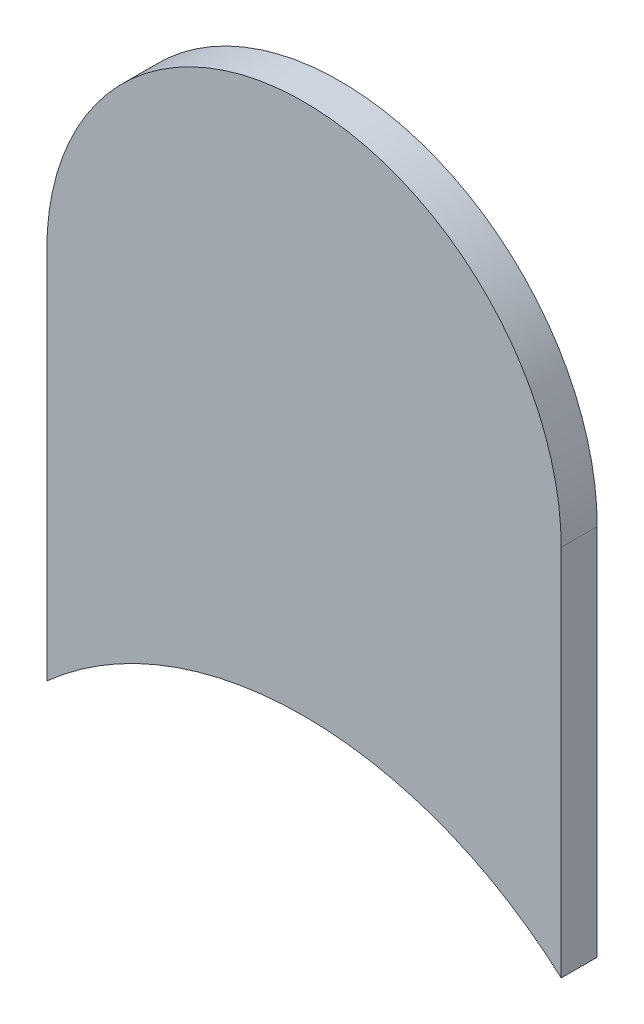
ISO-10303-21;
HEADER;
FILE_DESCRIPTION(('STEP AP214'),'2;1');
FILE_NAME('part.step','',(''),(''),'','','');
FILE_SCHEMA(('AUTOMOTIVE_DESIGN { 1 0 10303 214 1 1 1 1 }'));
ENDSEC;
DATA;
#1=APPLICATION_CONTEXT('core data for automotive mechanical design processes');
#2=APPLICATION_PROTOCOL_DEFINITION('international standard','automotive_design',2000,#1);
#3=PRODUCT_CONTEXT('',#1,'mechanical');
#4=PRODUCT('Part','Part','',(#3));
#5=PRODUCT_RELATED_PRODUCT_CATEGORY('part','',(#4));
#6=PRODUCT_DEFINITION_FORMATION('','',#4);
#7=PRODUCT_DEFINITION_CONTEXT('part definition',#1,'design');
#8=PRODUCT_DEFINITION('design','',#6,#7);
#9=PRODUCT_DEFINITION_SHAPE('','',#8);
#10=(LENGTH_UNIT() NAMED_UNIT(*) SI_UNIT(.MILLI.,.METRE.));
#11=(NAMED_UNIT(*) PLANE_ANGLE_UNIT() SI_UNIT($,.RADIAN.));
#12=(NAMED_UNIT(*) SI_UNIT($,.STERADIAN.) SOLID_ANGLE_UNIT());
#13=UNCERTAINTY_MEASURE_WITH_UNIT(LENGTH_MEASURE(1.E-05),#10,'distance_accuracy_value','');
#14=(GEOMETRIC_REPRESENTATION_CONTEXT(3) GLOBAL_UNCERTAINTY_ASSIGNED_CONTEXT((#13)) GLOBAL_UNIT_ASSIGNED_CONTEXT((#10,
#11,#12)) REPRESENTATION_CONTEXT('',''));
#15=CARTESIAN_POINT('',(0.,0.,0.));
#16=DIRECTION('',(0.,0.,1.));
#17=DIRECTION('',(1.,0.,0.));
#18=AXIS2_PLACEMENT_3D('',#15,#16,#17);
#19=CARTESIAN_POINT('',(148.594,-72.510019,-0.035));
#20=DIRECTION('',(1.,0.,0.));
#21=DIRECTION('',(0.,1.,0.));
#22=AXIS2_PLACEMENT_3D('',#19,#20,#21);
#23=PLANE('',#22);
#24=DIRECTION('',(0.,0.,-1.));
#25=VECTOR('',#24,1.);
#26=CARTESIAN_POINT('',(148.594,-72.87249150281,-0.045));
#27=LINE('',#26,#25);
#28=CARTESIAN_POINT('',(148.594,-72.8724915028,0.));
#29=VERTEX_POINT('',#28);
#30=CARTESIAN_POINT('',(148.594,-72.8724915028,-0.035));
#31=VERTEX_POINT('',#30);
#32=EDGE_CURVE('E11',#29,#31,#27,.T.);
#33=ORIENTED_EDGE('',*,*,#32,.F.);
#34=DIRECTION('',(0.,-1.,0.));
#35=VECTOR('',#34,1.);
#36=CARTESIAN_POINT('',(148.594,-72.510019,0.));
#37=LINE('',#36,#35);
#38=CARTESIAN_POINT('',(148.594,-72.510019,0.));
#39=VERTEX_POINT('',#38);
#40=EDGE_CURVE('E20',#39,#29,#37,.T.);
#41=ORIENTED_EDGE('',*,*,#40,.F.);
#42=DIRECTION('',(0.,0.,1.));
#43=VECTOR('',#42,1.);
#44=CARTESIAN_POINT('',(148.594,-72.510019,-0.035));
#45=LINE('',#44,#43);
#46=CARTESIAN_POINT('',(148.594,-72.510019,-0.035));
#47=VERTEX_POINT('',#46);
#48=EDGE_CURVE('E80',#47,#39,#45,.T.);
#49=ORIENTED_EDGE('',*,*,#48,.F.);
#50=DIRECTION('',(0.,-1.,0.));
#51=VECTOR('',#50,1.);
#52=CARTESIAN_POINT('',(148.594,-72.510019,-0.035));
#53=LINE('',#52,#51);
#54=EDGE_CURVE('E88',#47,#31,#53,.T.);
#55=ORIENTED_EDGE('',*,*,#54,.T.);
#56=EDGE_LOOP('',(#33,#41,#49,#55));
#57=FACE_BOUND('',#56,.T.);
#58=ADVANCED_FACE('F17',(#57),#23,.F.);
#59=CARTESIAN_POINT('',(148.844,-73.152,-0.045));
#60=DIRECTION('',(0.,0.,-1.));
#61=DIRECTION('',(0.,-1.,0.));
#62=AXIS2_PLACEMENT_3D('',#59,#60,#61);
#63=CYLINDRICAL_SURFACE('',#62,0.375);
#64=DIRECTION('',(0.,0.,-1.));
#65=VECTOR('',#64,1.);
#66=CARTESIAN_POINT('',(149.094,-72.87249150281,-0.045));
#67=LINE('',#66,#65);
#68=CARTESIAN_POINT('',(149.094,-72.87249150282,0.));
#69=VERTEX_POINT('',#68);
#70=CARTESIAN_POINT('',(149.094,-72.87249150282,-0.035));
#71=VERTEX_POINT('',#70);
#72=EDGE_CURVE('E101',#69,#71,#67,.T.);
#73=ORIENTED_EDGE('',*,*,#72,.F.);
#74=CARTESIAN_POINT('',(148.844,-73.152,0.));
#75=DIRECTION('',(0.,0.,-1.));
#76=DIRECTION('',(0.,-1.,0.));
#77=AXIS2_PLACEMENT_3D('',#74,#75,#76);
#78=CIRCLE('',#77,0.375);
#79=EDGE_CURVE('E55',#29,#69,#78,.T.);
#80=ORIENTED_EDGE('',*,*,#79,.F.);
#81=ORIENTED_EDGE('',*,*,#32,.T.);
#82=CARTESIAN_POINT('',(148.844,-73.152,-0.035));
#83=DIRECTION('',(0.,0.,-1.));
#84=DIRECTION('',(0.,-1.,0.));
#85=AXIS2_PLACEMENT_3D('',#82,#83,#84);
#86=CIRCLE('',#85,0.375);
#87=EDGE_CURVE('E86',#31,#71,#86,.T.);
#88=ORIENTED_EDGE('',*,*,#87,.T.);
#89=EDGE_LOOP('',(#73,#80,#81,#88));
#90=FACE_BOUND('',#89,.T.);
#91=ADVANCED_FACE('F85',(#90),#63,.F.);
#92=CARTESIAN_POINT('',(149.094,-73.152,0.));
#93=DIRECTION('',(0.,0.,1.));
#94=DIRECTION('',(1.,0.,0.));
#95=AXIS2_PLACEMENT_3D('',#92,#93,#94);
#96=PLANE('',#95);
#97=ORIENTED_EDGE('',*,*,#79,.T.);
#98=DIRECTION('',(0.,1.,0.));
#99=VECTOR('',#98,1.);
#100=CARTESIAN_POINT('',(149.094,-73.152,0.));
#101=LINE('',#100,#99);
#102=CARTESIAN_POINT('',(149.094,-72.510019,0.));
#103=VERTEX_POINT('',#102);
#104=EDGE_CURVE('E105',#69,#103,#101,.T.);
#105=ORIENTED_EDGE('',*,*,#104,.T.);
#106=CARTESIAN_POINT('',(148.844,-72.510019,0.));
#107=DIRECTION('',(0.,0.,1.));
#108=DIRECTION('',(1.,0.,0.));
#109=AXIS2_PLACEMENT_3D('',#106,#107,#108);
#110=CIRCLE('',#109,0.25);
#111=EDGE_CURVE('E65',#103,#39,#110,.T.);
#112=ORIENTED_EDGE('',*,*,#111,.T.);
#113=ORIENTED_EDGE('',*,*,#40,.T.);
#114=EDGE_LOOP('',(#97,#105,#112,#113));
#115=FACE_BOUND('',#114,.T.);
#116=ADVANCED_FACE('F116',(#115),#96,.T.);
#117=CARTESIAN_POINT('',(148.844,-72.510019,-0.035));
#118=DIRECTION('',(0.,0.,-1.));
#119=DIRECTION('',(1.,0.,0.));
#120=AXIS2_PLACEMENT_3D('',#117,#118,#119);
#121=CYLINDRICAL_SURFACE('',#120,0.25);
#122=CARTESIAN_POINT('',(148.844,-72.510019,-0.035));
#123=DIRECTION('',(0.,0.,1.));
#124=DIRECTION('',(1.,0.,0.));
#125=AXIS2_PLACEMENT_3D('',#122,#123,#124);
#126=CIRCLE('',#125,0.25);
#127=CARTESIAN_POINT('',(149.094,-72.510019,-0.035));
#128=VERTEX_POINT('',#127);
#129=EDGE_CURVE('E75',#128,#47,#126,.T.);
#130=ORIENTED_EDGE('',*,*,#129,.T.);
#131=ORIENTED_EDGE('',*,*,#48,.T.);
#132=ORIENTED_EDGE('',*,*,#111,.F.);
#133=DIRECTION('',(0.,0.,1.));
#134=VECTOR('',#133,1.);
#135=CARTESIAN_POINT('',(149.094,-72.510019,-0.035));
#136=LINE('',#135,#134);
#137=EDGE_CURVE('E120',#128,#103,#136,.T.);
#138=ORIENTED_EDGE('',*,*,#137,.F.);
#139=EDGE_LOOP('',(#130,#131,#132,#138));
#140=FACE_BOUND('',#139,.T.);
#141=ADVANCED_FACE('F119',(#140),#121,.T.);
#142=CARTESIAN_POINT('',(149.094,-73.152,-0.035));
#143=DIRECTION('',(0.,0.,1.));
#144=DIRECTION('',(1.,0.,0.));
#145=AXIS2_PLACEMENT_3D('',#142,#143,#144);
#146=PLANE('',#145);
#147=ORIENTED_EDGE('',*,*,#54,.F.);
#148=ORIENTED_EDGE('',*,*,#129,.F.);
#149=DIRECTION('',(0.,1.,0.));
#150=VECTOR('',#149,1.);
#151=CARTESIAN_POINT('',(149.094,-73.152,-0.035));
#152=LINE('',#151,#150);
#153=EDGE_CURVE('E89',#71,#128,#152,.T.);
#154=ORIENTED_EDGE('',*,*,#153,.F.);
#155=ORIENTED_EDGE('',*,*,#87,.F.);
#156=EDGE_LOOP('',(#147,#148,#154,#155));
#157=FACE_BOUND('',#156,.T.);
#158=ADVANCED_FACE('F87',(#157),#146,.F.);
#159=CARTESIAN_POINT('',(149.094,-73.152,-0.035));
#160=DIRECTION('',(-1.,0.,0.));
#161=DIRECTION('',(0.,0.,1.));
#162=AXIS2_PLACEMENT_3D('',#159,#160,#161);
#163=PLANE('',#162);
#164=ORIENTED_EDGE('',*,*,#137,.T.);
#165=ORIENTED_EDGE('',*,*,#104,.F.);
#166=ORIENTED_EDGE('',*,*,#72,.T.);
#167=ORIENTED_EDGE('',*,*,#153,.T.);
#168=EDGE_LOOP('',(#164,#165,#166,#167));
#169=FACE_BOUND('',#168,.T.);
#170=ADVANCED_FACE('F130',(#169),#163,.F.);
#171=CLOSED_SHELL('',(#58,#91,#116,#141,#158,#170));
#172=MANIFOLD_SOLID_BREP('B1',#171);
#173=ADVANCED_BREP_SHAPE_REPRESENTATION('',(#18,#172),#14);
#174=SHAPE_DEFINITION_REPRESENTATION(#9,#173);
ENDSEC;
END-ISO-10303-21;
